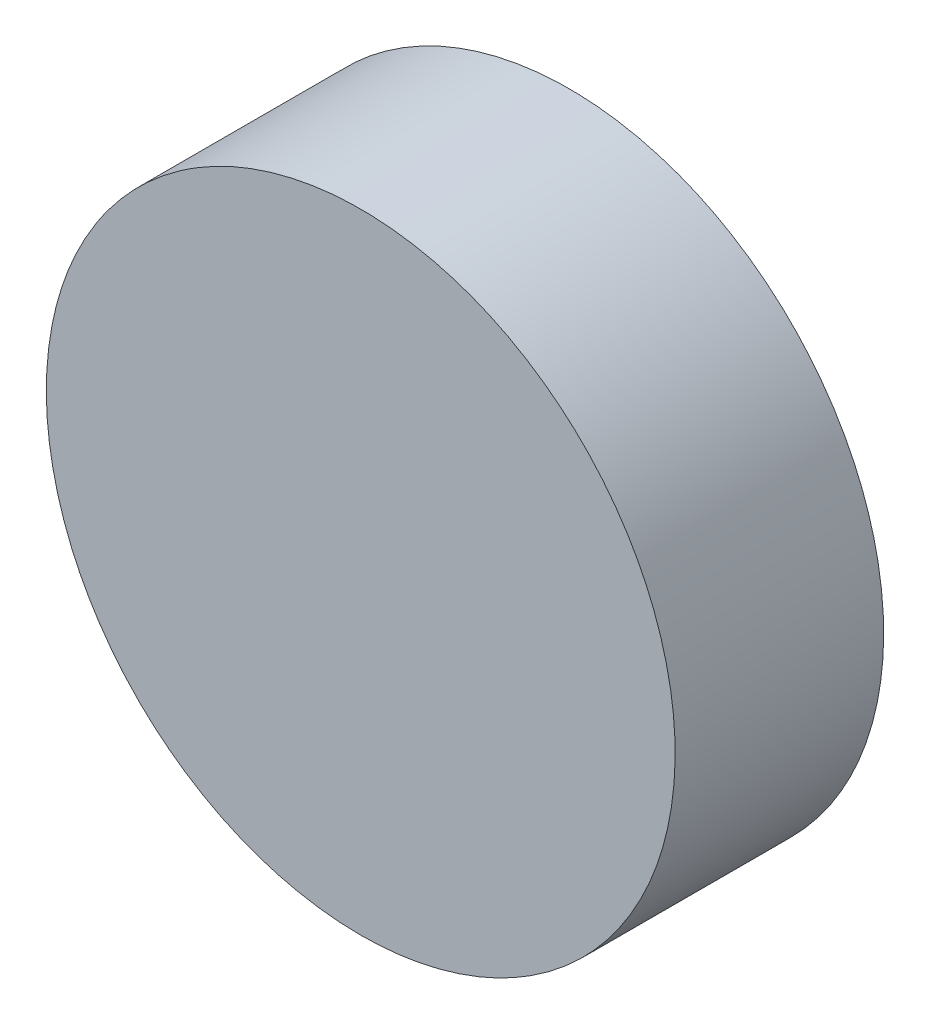
ISO-10303-21;
HEADER;
FILE_DESCRIPTION(('STEP AP214'),'2;1');
FILE_NAME('part.step','',(''),(''),'','','');
FILE_SCHEMA(('AUTOMOTIVE_DESIGN { 1 0 10303 214 1 1 1 1 }'));
ENDSEC;
DATA;
#1=APPLICATION_CONTEXT('core data for automotive mechanical design processes');
#2=APPLICATION_PROTOCOL_DEFINITION('international standard','automotive_design',2000,#1);
#3=PRODUCT_CONTEXT('',#1,'mechanical');
#4=PRODUCT('Part','Part','',(#3));
#5=PRODUCT_RELATED_PRODUCT_CATEGORY('part','',(#4));
#6=PRODUCT_DEFINITION_FORMATION('','',#4);
#7=PRODUCT_DEFINITION_CONTEXT('part definition',#1,'design');
#8=PRODUCT_DEFINITION('design','',#6,#7);
#9=PRODUCT_DEFINITION_SHAPE('','',#8);
#10=(LENGTH_UNIT() NAMED_UNIT(*) SI_UNIT(.MILLI.,.METRE.));
#11=(NAMED_UNIT(*) PLANE_ANGLE_UNIT() SI_UNIT($,.RADIAN.));
#12=(NAMED_UNIT(*) SI_UNIT($,.STERADIAN.) SOLID_ANGLE_UNIT());
#13=UNCERTAINTY_MEASURE_WITH_UNIT(LENGTH_MEASURE(1.E-05),#10,'distance_accuracy_value','');
#14=(GEOMETRIC_REPRESENTATION_CONTEXT(3) GLOBAL_UNCERTAINTY_ASSIGNED_CONTEXT((#13)) GLOBAL_UNIT_ASSIGNED_CONTEXT((#10,
#11,#12)) REPRESENTATION_CONTEXT('',''));
#15=CARTESIAN_POINT('',(0.,0.,0.));
#16=DIRECTION('',(0.,0.,1.));
#17=DIRECTION('',(1.,0.,0.));
#18=AXIS2_PLACEMENT_3D('',#15,#16,#17);
#19=CARTESIAN_POINT('',(3.01151364375242,66.8258452741405,123.808385168912));
#20=CARTESIAN_POINT('',(3.17974362296006,66.8258452741405,123.808385168912));
#21=CARTESIAN_POINT('',(3.51620358137534,66.8927713209974,123.808385168912));
#22=CARTESIAN_POINT('',(3.94405905102085,67.1786552059314,123.808385168912));
#23=CARTESIAN_POINT('',(4.22994293595491,67.606510675577,123.808385168912));
#24=CARTESIAN_POINT('',(4.33033200624017,68.1112006131998,123.808385168912));
#25=CARTESIAN_POINT('',(4.22994293595491,68.6158905508228,123.808385168912));
#26=CARTESIAN_POINT('',(3.94405905102085,69.0437460204683,123.808385168912));
#27=CARTESIAN_POINT('',(3.51620358137534,69.3296299054023,123.808385168912));
#28=CARTESIAN_POINT('',(3.01151364375242,69.4300189756876,123.808385168912));
#29=CARTESIAN_POINT('',(2.50682370612951,69.3296299054023,123.808385168912));
#30=CARTESIAN_POINT('',(2.078968236484,69.0437460204683,123.808385168912));
#31=CARTESIAN_POINT('',(1.79308435154994,68.6158905508227,123.808385168912));
#32=CARTESIAN_POINT('',(1.69269528126467,68.1112006131999,123.808385168912));
#33=CARTESIAN_POINT('',(1.79308435154994,67.606510675577,123.808385168912));
#34=CARTESIAN_POINT('',(2.078968236484,67.1786552059314,123.808385168912));
#35=CARTESIAN_POINT('',(2.50682370612951,66.8927713209974,123.808385168912));
#36=CARTESIAN_POINT('',(2.84328366454478,66.8258452741405,123.808385168912));
#37=CARTESIAN_POINT('',(3.01151364375242,66.8258452741405,123.808385168912));
#38=B_SPLINE_CURVE_WITH_KNOTS('',3,(#19,#20,#21,#22,#23,#24,#25,#26,#27,#28,#29,#30,#31,#32,#33,
#34,#35,#36,#37),.UNSPECIFIED.,.T.,.F.,(4,1,1,1,1,1,1,1,1,1,1,1,1,1,1,1,4),(0.,
0.0625000000000002,0.125,0.187499999999999,0.25,0.312500000000001,0.375,0.4375,0.5,0.5625,0.625,
0.687499999999999,0.75,0.812500000000001,0.875,0.9375,1.),.UNSPECIFIED.);
#39=DIRECTION('',(0.,0.,1.));
#40=VECTOR('',#39,1.);
#41=SURFACE_OF_LINEAR_EXTRUSION('',#38,#40);
#42=CARTESIAN_POINT('',(3.01151364375242,66.8258452741405,123.808385168912));
#43=CARTESIAN_POINT('',(3.17974362296006,66.8258452741405,123.808385168912));
#44=CARTESIAN_POINT('',(3.51620358137534,66.8927713209974,123.808385168912));
#45=CARTESIAN_POINT('',(3.94405905102085,67.1786552059314,123.808385168912));
#46=CARTESIAN_POINT('',(4.22994293595491,67.606510675577,123.808385168912));
#47=CARTESIAN_POINT('',(4.33033200624017,68.1112006131998,123.808385168912));
#48=CARTESIAN_POINT('',(4.22994293595491,68.6158905508228,123.808385168912));
#49=CARTESIAN_POINT('',(3.94405905102085,69.0437460204683,123.808385168912));
#50=CARTESIAN_POINT('',(3.51620358137534,69.3296299054023,123.808385168912));
#51=CARTESIAN_POINT('',(3.01151364375242,69.4300189756876,123.808385168912));
#52=CARTESIAN_POINT('',(2.50682370612951,69.3296299054023,123.808385168912));
#53=CARTESIAN_POINT('',(2.078968236484,69.0437460204683,123.808385168912));
#54=CARTESIAN_POINT('',(1.79308435154994,68.6158905508227,123.808385168912));
#55=CARTESIAN_POINT('',(1.69269528126467,68.1112006131999,123.808385168912));
#56=CARTESIAN_POINT('',(1.79308435154994,67.606510675577,123.808385168912));
#57=CARTESIAN_POINT('',(2.078968236484,67.1786552059314,123.808385168912));
#58=CARTESIAN_POINT('',(2.50682370612951,66.8927713209974,123.808385168912));
#59=CARTESIAN_POINT('',(2.84328366454478,66.8258452741405,123.808385168912));
#60=CARTESIAN_POINT('',(3.01151364375242,66.8258452741405,123.808385168912));
#61=B_SPLINE_CURVE_WITH_KNOTS('',3,(#42,#43,#44,#45,#46,#47,#48,#49,#50,#51,#52,#53,#54,#55,#56,
#57,#58,#59,#60),.UNSPECIFIED.,.T.,.F.,(4,1,1,1,1,1,1,1,1,1,1,1,1,1,1,1,4),(0.,
0.0625000000000002,0.125,0.187499999999999,0.25,0.312500000000001,0.375,0.4375,0.5,0.5625,0.625,
0.687499999999999,0.75,0.812500000000001,0.875,0.9375,1.),.UNSPECIFIED.);
#62=CARTESIAN_POINT('',(3.01151364375242,66.8258452741405,123.808385168912));
#63=VERTEX_POINT('',#62);
#64=EDGE_CURVE('E9',#63,#63,#61,.T.);
#65=ORIENTED_EDGE('',*,*,#64,.T.);
#66=EDGE_LOOP('',(#65));
#67=FACE_BOUND('',#66,.T.);
#68=CARTESIAN_POINT('',(3.01151364375242,66.8258452741405,124.660837467507));
#69=CARTESIAN_POINT('',(2.99048440016308,66.8258452589163,124.660837467507));
#70=CARTESIAN_POINT('',(2.96945559306154,66.8263681567347,124.660837467507));
#71=CARTESIAN_POINT('',(2.92744799680097,66.8284496611393,124.660837467507));
#72=CARTESIAN_POINT('',(2.90646921065742,66.8300083286574,124.660837467507));
#73=CARTESIAN_POINT('',(2.86461185127281,66.8341513949177,124.660837467507));
#74=CARTESIAN_POINT('',(2.84373328500815,66.8367358640485,124.660837467507));
#75=CARTESIAN_POINT('',(2.80212625785453,66.8429205914181,124.660837467507));
#76=CARTESIAN_POINT('',(2.78139780347898,66.8465208934665,124.660837467507));
#77=CARTESIAN_POINT('',(2.74014098256868,66.8547273847104,124.660837467507));
#78=CARTESIAN_POINT('',(2.71961261603394,66.8593335739059,124.660837467507));
#79=CARTESIAN_POINT('',(2.67880593450038,66.8695419551315,124.660837467507));
#80=CARTESIAN_POINT('',(2.65852760875462,66.8751441041938,124.660837467507));
#81=CARTESIAN_POINT('',(2.61827100073123,66.8873345121516,124.660837467507));
#82=CARTESIAN_POINT('',(2.59829269795855,66.8939227033487,124.660837467507));
#83=CARTESIAN_POINT('',(2.55868606070803,66.9080753143805,124.660837467507));
#84=CARTESIAN_POINT('',(2.53905770571091,66.9156396767615,124.660837467507));
#85=CARTESIAN_POINT('',(2.5002011958739,66.9317345701161,124.660837467507));
#86=CARTESIAN_POINT('',(2.48097304103401,66.9402651010898,124.660837467507));
#87=CARTESIAN_POINT('',(2.44295951199244,66.9582638156752,124.660837467507));
#88=CARTESIAN_POINT('',(2.42417416390736,66.9677320544222,124.660837467507));
#89=CARTESIAN_POINT('',(2.38708852337705,66.9875778546708,124.660837467507));
#90=CARTESIAN_POINT('',(2.36878826430963,66.9979554785345,124.660837467507));
#91=CARTESIAN_POINT('',(2.33271516702765,67.0195917446972,124.660837467507));
#92=CARTESIAN_POINT('',(2.31494235159661,67.0308504249783,124.660837467507));
#93=CARTESIAN_POINT('',(2.27996650987893,67.0542205352572,124.660837467507));
#94=CARTESIAN_POINT('',(2.26276348359229,67.0663319652551,124.660837467507));
#95=CARTESIAN_POINT('',(2.22896960344062,67.0913793209098,124.660837467507));
#96=CARTESIAN_POINT('',(2.21237872320365,67.1043152109822,124.660837467507));
#97=CARTESIAN_POINT('',(2.17985153433839,67.1309832162601,124.660837467507));
#98=CARTESIAN_POINT('',(2.16391518086813,67.1447152767636,124.660837467507));
#99=CARTESIAN_POINT('',(2.13273938908003,67.1729473883313,124.660837467507));
#100=CARTESIAN_POINT('',(2.11749990981826,67.1874473941676,124.660837467507));
#101=CARTESIAN_POINT('',(2.08776042472021,67.2171868792657,124.660837467507));
#102=CARTESIAN_POINT('',(2.07326041888392,67.2324263585275,124.660837467507));
#103=CARTESIAN_POINT('',(2.0450283073162,67.2636021503156,124.660837467507));
#104=CARTESIAN_POINT('',(2.03129624681271,67.2795385037858,124.660837467507));
#105=CARTESIAN_POINT('',(2.00462824153475,67.3120656926511,124.660837467507));
#106=CARTESIAN_POINT('',(1.99169235146232,67.328656572888,124.660837467507));
#107=CARTESIAN_POINT('',(1.96664499580767,67.3624504530397,124.660837467507));
#108=CARTESIAN_POINT('',(1.95453356580978,67.3796534793264,124.660837467507));
#109=CARTESIAN_POINT('',(1.93116345553083,67.414629321044,124.660837467507));
#110=CARTESIAN_POINT('',(1.91990477524976,67.4324021364749,124.660837467507));
#111=CARTESIAN_POINT('',(1.89826850908708,67.4684752337572,124.660837467507));
#112=CARTESIAN_POINT('',(1.88789088522342,67.486775492825,124.660837467507));
#113=CARTESIAN_POINT('',(1.86804508497478,67.5238611333543,124.660837467507));
#114=CARTESIAN_POINT('',(1.85857684622766,67.5426464814381,124.660837467507));
#115=CARTESIAN_POINT('',(1.84057813164245,67.5806600104832,124.660837467507));
#116=CARTESIAN_POINT('',(1.83204760066912,67.599888165328,124.660837467507));
#117=CARTESIAN_POINT('',(1.81595270731369,67.6387446751517,124.660837467507));
#118=CARTESIAN_POINT('',(1.8083883449316,67.6583730301305,124.660837467507));
#119=CARTESIAN_POINT('',(1.79423573390278,67.697979667431,124.660837467507));
#120=CARTESIAN_POINT('',(1.78764754270978,67.717957970272,124.660837467507));
#121=CARTESIAN_POINT('',(1.77545713474072,67.7582145781088,124.660837467507));
#122=CARTESIAN_POINT('',(1.76985498566302,67.7784929035997,124.660837467507));
#123=CARTESIAN_POINT('',(1.75964660447954,67.8192995858295,124.660837467507));
#124=CARTESIAN_POINT('',(1.7550404153415,67.8398279533155,124.660837467507));
#125=CARTESIAN_POINT('',(1.74683392394059,67.881084771627,124.660837467507));
#126=CARTESIAN_POINT('',(1.74323362167773,67.9018132224526,124.660837467507));
#127=CARTESIAN_POINT('',(1.73704889489406,67.9434202593047,124.660837467507));
#128=CARTESIAN_POINT('',(1.73446442656356,67.964298838817,124.660837467507));
#129=CARTESIAN_POINT('',(1.73032135811676,68.0061561620093,124.660837467507));
#130=CARTESIAN_POINT('',(1.72876268761223,68.0271348987172,124.660837467507));
#131=CARTESIAN_POINT('',(1.72668119136676,68.0691426300362,124.660837467507));
#132=CARTESIAN_POINT('',(1.7261583046931,68.090171621618,124.660837467507));
#133=CARTESIAN_POINT('',(1.7261583046931,68.1322296047817,124.660837467507));
#134=CARTESIAN_POINT('',(1.72668119136676,68.1532585963635,124.660837467507));
#135=CARTESIAN_POINT('',(1.72876268761223,68.1952663276825,124.660837467507));
#136=CARTESIAN_POINT('',(1.73032135811676,68.2162450643904,124.660837467507));
#137=CARTESIAN_POINT('',(1.73446442656356,68.2581023875827,124.660837467507));
#138=CARTESIAN_POINT('',(1.73704889489406,68.278980967095,124.660837467507));
#139=CARTESIAN_POINT('',(1.74323362167773,68.3205880039471,124.660837467507));
#140=CARTESIAN_POINT('',(1.74683392394059,68.3413164547727,124.660837467507));
#141=CARTESIAN_POINT('',(1.75504041534149,68.3825732730842,124.660837467507));
#142=CARTESIAN_POINT('',(1.75964660447954,68.4031016405702,124.660837467507));
#143=CARTESIAN_POINT('',(1.76985498566302,68.4439083228,124.660837467507));
#144=CARTESIAN_POINT('',(1.77545713474072,68.4641866482909,124.660837467507));
#145=CARTESIAN_POINT('',(1.78764754270978,68.5044432561278,124.660837467507));
#146=CARTESIAN_POINT('',(1.79423573390278,68.5244215589687,124.660837467507));
#147=CARTESIAN_POINT('',(1.8083883449316,68.5640281962692,124.660837467507));
#148=CARTESIAN_POINT('',(1.81595270731369,68.5836565512481,124.660837467507));
#149=CARTESIAN_POINT('',(1.83204760066911,68.6225130610717,124.660837467507));
#150=CARTESIAN_POINT('',(1.84057813164245,68.6417412159165,124.660837467507));
#151=CARTESIAN_POINT('',(1.85857684622766,68.6797547449616,124.660837467507));
#152=CARTESIAN_POINT('',(1.86804508497477,68.6985400930454,124.660837467507));
#153=CARTESIAN_POINT('',(1.88789088522341,68.7356257335747,124.660837467507));
#154=CARTESIAN_POINT('',(1.89826850908708,68.7539259926425,124.660837467507));
#155=CARTESIAN_POINT('',(1.91990477524977,68.7899990899247,124.660837467507));
#156=CARTESIAN_POINT('',(1.93116345553083,68.8077719053557,124.660837467507));
#157=CARTESIAN_POINT('',(1.95453356580978,68.8427477470733,124.660837467507));
#158=CARTESIAN_POINT('',(1.96664499580767,68.85995077336,124.660837467507));
#159=CARTESIAN_POINT('',(1.99169235146232,68.8937446535117,124.660837467507));
#160=CARTESIAN_POINT('',(2.00462824153476,68.9103355337486,124.660837467507));
#161=CARTESIAN_POINT('',(2.03129624681271,68.9428627226139,124.660837467507));
#162=CARTESIAN_POINT('',(2.0450283073162,68.9587990760841,124.660837467507));
#163=CARTESIAN_POINT('',(2.07326041888391,68.9899748678722,124.660837467507));
#164=CARTESIAN_POINT('',(2.08776042472021,69.005214347134,124.660837467507));
#165=CARTESIAN_POINT('',(2.11749990981827,69.0349538322321,124.660837467507));
#166=CARTESIAN_POINT('',(2.13273938908003,69.0494538380684,124.660837467507));
#167=CARTESIAN_POINT('',(2.16391518086813,69.0776859496361,124.660837467507));
#168=CARTESIAN_POINT('',(2.17985153433839,69.0914180101396,124.660837467507));
#169=CARTESIAN_POINT('',(2.21237872320365,69.1180860154175,124.660837467507));
#170=CARTESIAN_POINT('',(2.22896960344062,69.1310219054899,124.660837467507));
#171=CARTESIAN_POINT('',(2.2627634835923,69.1560692611446,124.660837467507));
#172=CARTESIAN_POINT('',(2.27996650987896,69.1681806911425,124.660837467507));
#173=CARTESIAN_POINT('',(2.31494235159657,69.1915508014214,124.660837467507));
#174=CARTESIAN_POINT('',(2.33271516702752,69.2028094817025,124.660837467507));
#175=CARTESIAN_POINT('',(2.36878826430976,69.2244457478652,124.660837467507));
#176=CARTESIAN_POINT('',(2.38708852337753,69.2348233717289,124.660837467507));
#177=CARTESIAN_POINT('',(2.42417416390688,69.2546691719775,124.660837467507));
#178=CARTESIAN_POINT('',(2.44295951199065,69.2641374107246,124.660837467507));
#179=CARTESIAN_POINT('',(2.48097304103581,69.2821361253098,124.660837467507));
#180=CARTESIAN_POINT('',(2.5002011958806,69.2906666562832,124.660837467507));
#181=CARTESIAN_POINT('',(2.53905770570422,69.3067615496386,124.660837467507));
#182=CARTESIAN_POINT('',(2.55868606068304,69.3143259120207,124.660837467507));
#183=CARTESIAN_POINT('',(2.59829269798354,69.3284785230495,124.660837467507));
#184=CARTESIAN_POINT('',(2.6182710008245,69.3350667142425,124.660837467507));
#185=CARTESIAN_POINT('',(2.65852760866134,69.3472571222116,124.660837467507));
#186=CARTESIAN_POINT('',(2.67880593415224,69.3528592712893,124.660837467507));
#187=CARTESIAN_POINT('',(2.7196126163821,69.3630676524727,124.660837467507));
#188=CARTESIAN_POINT('',(2.74014098386805,69.3676738416108,124.660837467507));
#189=CARTESIAN_POINT('',(2.78139780217961,69.3758803330117,124.660837467507));
#190=CARTESIAN_POINT('',(2.80212625300521,69.3794806352745,124.660837467507));
#191=CARTESIAN_POINT('',(2.84373328985726,69.3856653620582,124.660837467507));
#192=CARTESIAN_POINT('',(2.86461186936958,69.3882498303887,124.660837467507));
#193=CARTESIAN_POINT('',(2.90646919256189,69.3923928988355,124.660837467507));
#194=CARTESIAN_POINT('',(2.92744792926979,69.3939515693401,124.660837467507));
#195=CARTESIAN_POINT('',(2.96945566058876,69.3960330655855,124.660837467507));
#196=CARTESIAN_POINT('',(2.99048465217059,69.3965559522592,124.660837467507));
#197=CARTESIAN_POINT('',(3.03254263533426,69.3965559522592,124.660837467507));
#198=CARTESIAN_POINT('',(3.05357162691609,69.3960330655855,124.660837467507));
#199=CARTESIAN_POINT('',(3.09557935823506,69.3939515693401,124.660837467507));
#200=CARTESIAN_POINT('',(3.11655809494295,69.3923928988355,124.660837467507));
#201=CARTESIAN_POINT('',(3.15841541813527,69.3882498303887,124.660837467507));
#202=CARTESIAN_POINT('',(3.17929399764758,69.3856653620582,124.660837467507));
#203=CARTESIAN_POINT('',(3.22090103449963,69.3794806352745,124.660837467507));
#204=CARTESIAN_POINT('',(3.24162948532524,69.3758803330117,124.660837467507));
#205=CARTESIAN_POINT('',(3.2828863036368,69.3676738416108,124.660837467507));
#206=CARTESIAN_POINT('',(3.30341467112274,69.3630676524727,124.660837467507));
#207=CARTESIAN_POINT('',(3.34422135335261,69.3528592712893,124.660837467507));
#208=CARTESIAN_POINT('',(3.3644996788435,69.3472571222116,124.660837467507));
#209=CARTESIAN_POINT('',(3.40475628668034,69.3350667142425,124.660837467507));
#210=CARTESIAN_POINT('',(3.4247345895213,69.3284785230495,124.660837467507));
#211=CARTESIAN_POINT('',(3.46434122682181,69.3143259120207,124.660837467507));
#212=CARTESIAN_POINT('',(3.48396958180063,69.3067615496386,124.660837467507));
#213=CARTESIAN_POINT('',(3.52282609162425,69.2906666562832,124.660837467507));
#214=CARTESIAN_POINT('',(3.54205424646904,69.2821361253098,124.660837467507));
#215=CARTESIAN_POINT('',(3.5800677755142,69.2641374107246,124.660837467507));
#216=CARTESIAN_POINT('',(3.59885312359797,69.2546691719775,124.660837467507));
#217=CARTESIAN_POINT('',(3.63593876412731,69.2348233717289,124.660837467507));
#218=CARTESIAN_POINT('',(3.65423902319509,69.2244457478652,124.660837467507));
#219=CARTESIAN_POINT('',(3.69031212047733,69.2028094817025,124.660837467507));
#220=CARTESIAN_POINT('',(3.70808493590827,69.1915508014214,124.660837467507));
#221=CARTESIAN_POINT('',(3.74306077762588,69.1681806911425,124.660837467507));
#222=CARTESIAN_POINT('',(3.76026380391255,69.1560692611446,124.660837467507));
#223=CARTESIAN_POINT('',(3.79405768406423,69.1310219054899,124.660837467507));
#224=CARTESIAN_POINT('',(3.8106485643012,69.1180860154175,124.660837467507));
#225=CARTESIAN_POINT('',(3.84317575316646,69.0914180101396,124.660837467507));
#226=CARTESIAN_POINT('',(3.85911210663672,69.0776859496361,124.660837467507));
#227=CARTESIAN_POINT('',(3.89028789842481,69.0494538380683,124.660837467507));
#228=CARTESIAN_POINT('',(3.90552737768658,69.0349538322321,124.660837467507));
#229=CARTESIAN_POINT('',(3.93526686278464,69.005214347134,124.660837467507));
#230=CARTESIAN_POINT('',(3.94976686862093,68.9899748678722,124.660837467507));
#231=CARTESIAN_POINT('',(3.97799898018865,68.9587990760841,124.660837467507));
#232=CARTESIAN_POINT('',(3.99173104069214,68.9428627226139,124.660837467507));
#233=CARTESIAN_POINT('',(4.01839904597009,68.9103355337486,124.660837467507));
#234=CARTESIAN_POINT('',(4.03133493604253,68.8937446535117,124.660837467507));
#235=CARTESIAN_POINT('',(4.05638229169717,68.85995077336,124.660837467507));
#236=CARTESIAN_POINT('',(4.06849372169506,68.8427477470733,124.660837467507));
#237=CARTESIAN_POINT('',(4.09186383197402,68.8077719053557,124.660837467507));
#238=CARTESIAN_POINT('',(4.10312251225508,68.7899990899248,124.660837467507));
#239=CARTESIAN_POINT('',(4.12475877841777,68.7539259926425,124.660837467507));
#240=CARTESIAN_POINT('',(4.13513640228143,68.7356257335747,124.660837467507));
#241=CARTESIAN_POINT('',(4.15498220253007,68.6985400930454,124.660837467507));
#242=CARTESIAN_POINT('',(4.16445044127719,68.6797547449616,124.660837467507));
#243=CARTESIAN_POINT('',(4.1824491558624,68.6417412159165,124.660837467507));
#244=CARTESIAN_POINT('',(4.19097968683573,68.6225130610717,124.660837467507));
#245=CARTESIAN_POINT('',(4.20707458019116,68.5836565512481,124.660837467507));
#246=CARTESIAN_POINT('',(4.21463894257325,68.5640281962692,124.660837467507));
#247=CARTESIAN_POINT('',(4.22879155360207,68.5244215589687,124.660837467507));
#248=CARTESIAN_POINT('',(4.23537974479507,68.5044432561278,124.660837467507));
#249=CARTESIAN_POINT('',(4.24757015276413,68.4641866482909,124.660837467507));
#250=CARTESIAN_POINT('',(4.25317230184183,68.4439083228,124.660837467507));
#251=CARTESIAN_POINT('',(4.26338068302531,68.4031016405702,124.660837467507));
#252=CARTESIAN_POINT('',(4.26798687216335,68.3825732730842,124.660837467507));
#253=CARTESIAN_POINT('',(4.27619336356426,68.3413164547727,124.660837467507));
#254=CARTESIAN_POINT('',(4.27979366582711,68.3205880039471,124.660837467507));
#255=CARTESIAN_POINT('',(4.28597839261078,68.278980967095,124.660837467507));
#256=CARTESIAN_POINT('',(4.28856286094129,68.2581023875827,124.660837467507));
#257=CARTESIAN_POINT('',(4.29270592938809,68.2162450643904,124.660837467507));
#258=CARTESIAN_POINT('',(4.29426459989261,68.1952663276825,124.660837467507));
#259=CARTESIAN_POINT('',(4.29634609613809,68.1532585963635,124.660837467507));
#260=CARTESIAN_POINT('',(4.29686898281175,68.1322296047817,124.660837467507));
#261=CARTESIAN_POINT('',(4.29686898281175,68.090171621618,124.660837467507));
#262=CARTESIAN_POINT('',(4.29634609613809,68.0691426300362,124.660837467507));
#263=CARTESIAN_POINT('',(4.29426459989261,68.0271348987172,124.660837467507));
#264=CARTESIAN_POINT('',(4.29270592938809,68.0061561620093,124.660837467507));
#265=CARTESIAN_POINT('',(4.28856286094129,67.964298838817,124.660837467507));
#266=CARTESIAN_POINT('',(4.28597839261078,67.9434202593047,124.660837467507));
#267=CARTESIAN_POINT('',(4.27979366582711,67.9018132224526,124.660837467507));
#268=CARTESIAN_POINT('',(4.27619336356426,67.881084771627,124.660837467507));
#269=CARTESIAN_POINT('',(4.26798687216335,67.8398279533155,124.660837467507));
#270=CARTESIAN_POINT('',(4.26338068302531,67.8192995858295,124.660837467507));
#271=CARTESIAN_POINT('',(4.25317230184183,67.7784929035997,124.660837467507));
#272=CARTESIAN_POINT('',(4.24757015276413,67.7582145781088,124.660837467507));
#273=CARTESIAN_POINT('',(4.23537974479507,67.7179579702719,124.660837467507));
#274=CARTESIAN_POINT('',(4.22879155360207,67.697979667431,124.660837467507));
#275=CARTESIAN_POINT('',(4.21463894257325,67.6583730301305,124.660837467507));
#276=CARTESIAN_POINT('',(4.20707458019116,67.6387446751516,124.660837467507));
#277=CARTESIAN_POINT('',(4.19097968683573,67.599888165328,124.660837467507));
#278=CARTESIAN_POINT('',(4.1824491558624,67.5806600104832,124.660837467507));
#279=CARTESIAN_POINT('',(4.16445044127719,67.5426464814381,124.660837467507));
#280=CARTESIAN_POINT('',(4.15498220253007,67.5238611333543,124.660837467507));
#281=CARTESIAN_POINT('',(4.13513640228143,67.486775492825,124.660837467507));
#282=CARTESIAN_POINT('',(4.12475877841777,67.4684752337572,124.660837467507));
#283=CARTESIAN_POINT('',(4.10312251225508,67.432402136475,124.660837467507));
#284=CARTESIAN_POINT('',(4.09186383197402,67.414629321044,124.660837467507));
#285=CARTESIAN_POINT('',(4.06849372169507,67.3796534793264,124.660837467507));
#286=CARTESIAN_POINT('',(4.05638229169718,67.3624504530397,124.660837467507));
#287=CARTESIAN_POINT('',(4.03133493604253,67.328656572888,124.660837467507));
#288=CARTESIAN_POINT('',(4.01839904597009,67.3120656926511,124.660837467507));
#289=CARTESIAN_POINT('',(3.99173104069214,67.2795385037858,124.660837467507));
#290=CARTESIAN_POINT('',(3.97799898018865,67.2636021503156,124.660837467507));
#291=CARTESIAN_POINT('',(3.94976686862093,67.2324263585274,124.660837467507));
#292=CARTESIAN_POINT('',(3.93526686278464,67.2171868792657,124.660837467507));
#293=CARTESIAN_POINT('',(3.90552737768658,67.1874473941676,124.660837467507));
#294=CARTESIAN_POINT('',(3.89028789842481,67.1729473883313,124.660837467507));
#295=CARTESIAN_POINT('',(3.85911210663671,67.1447152767636,124.660837467507));
#296=CARTESIAN_POINT('',(3.84317575316645,67.1309832162601,124.660837467507));
#297=CARTESIAN_POINT('',(3.81064856430119,67.1043152109822,124.660837467507));
#298=CARTESIAN_POINT('',(3.79405768406422,67.0913793209098,124.660837467507));
#299=CARTESIAN_POINT('',(3.76026380391256,67.0663319652551,124.660837467507));
#300=CARTESIAN_POINT('',(3.74306077762592,67.0542205352572,124.660837467507));
#301=CARTESIAN_POINT('',(3.70808493590824,67.0308504249783,124.660837467507));
#302=CARTESIAN_POINT('',(3.6903121204772,67.0195917446972,124.660837467507));
#303=CARTESIAN_POINT('',(3.65423902319522,66.9979554785345,124.660837467507));
#304=CARTESIAN_POINT('',(3.63593876412779,66.9875778546708,124.660837467507));
#305=CARTESIAN_POINT('',(3.59885312359748,66.9677320544222,124.660837467507));
#306=CARTESIAN_POINT('',(3.5800677755124,66.9582638156752,124.660837467507));
#307=CARTESIAN_POINT('',(3.54205424647083,66.9402651010898,124.660837467507));
#308=CARTESIAN_POINT('',(3.52282609163094,66.9317345701161,124.660837467507));
#309=CARTESIAN_POINT('',(3.48396958179393,66.9156396767615,124.660837467507));
#310=CARTESIAN_POINT('',(3.46434122679682,66.9080753143805,124.660837467507));
#311=CARTESIAN_POINT('',(3.4247345895463,66.8939227033487,124.660837467507));
#312=CARTESIAN_POINT('',(3.40475628677362,66.8873345121516,124.660837467507));
#313=CARTESIAN_POINT('',(3.36449967875022,66.8751441041938,124.660837467507));
#314=CARTESIAN_POINT('',(3.34422135300447,66.8695419551315,124.660837467507));
#315=CARTESIAN_POINT('',(3.3034146714709,66.8593335739059,124.660837467507));
#316=CARTESIAN_POINT('',(3.28288630493617,66.8547273847104,124.660837467507));
#317=CARTESIAN_POINT('',(3.24162948402587,66.8465208934665,124.660837467507));
#318=CARTESIAN_POINT('',(3.22090102965031,66.8429205914181,124.660837467507));
#319=CARTESIAN_POINT('',(3.1792940024967,66.8367358640485,124.660837467507));
#320=CARTESIAN_POINT('',(3.15841543623204,66.8341513949177,124.660837467507));
#321=CARTESIAN_POINT('',(3.11655807684742,66.8300083286574,124.660837467507));
#322=CARTESIAN_POINT('',(3.09557929070387,66.8284496611393,124.660837467507));
#323=CARTESIAN_POINT('',(3.0535716944433,66.8263681567347,124.660837467507));
#324=CARTESIAN_POINT('',(3.03254288734177,66.8258452589163,124.660837467507));
#325=CARTESIAN_POINT('',(3.01151364375242,66.8258452741405,124.660837467507));
#326=B_SPLINE_CURVE_WITH_KNOTS('',3,(#68,#69,#70,#71,#72,#73,#74,#75,#76,#77,#78,#79,#80,#81,
#82,#83,#84,#85,#86,#87,#88,#89,#90,#91,#92,#93,#94,#95,#96,#97,#98,#99,#100,#101,#102,#103,
#104,#105,#106,#107,#108,#109,#110,#111,#112,#113,#114,#115,#116,#117,#118,#119,#120,#121,#122,
#123,#124,#125,#126,#127,#128,#129,#130,#131,#132,#133,#134,#135,#136,#137,#138,#139,#140,#141,
#142,#143,#144,#145,#146,#147,#148,#149,#150,#151,#152,#153,#154,#155,#156,#157,#158,#159,#160,
#161,#162,#163,#164,#165,#166,#167,#168,#169,#170,#171,#172,#173,#174,#175,#176,#177,#178,#179,
#180,#181,#182,#183,#184,#185,#186,#187,#188,#189,#190,#191,#192,#193,#194,#195,#196,#197,#198,
#199,#200,#201,#202,#203,#204,#205,#206,#207,#208,#209,#210,#211,#212,#213,#214,#215,#216,#217,
#218,#219,#220,#221,#222,#223,#224,#225,#226,#227,#228,#229,#230,#231,#232,#233,#234,#235,#236,
#237,#238,#239,#240,#241,#242,#243,#244,#245,#246,#247,#248,#249,#250,#251,#252,#253,#254,#255,
#256,#257,#258,#259,#260,#261,#262,#263,#264,#265,#266,#267,#268,#269,#270,#271,#272,#273,#274,
#275,#276,#277,#278,#279,#280,#281,#282,#283,#284,#285,#286,#287,#288,#289,#290,#291,#292,#293,
#294,#295,#296,#297,#298,#299,#300,#301,#302,#303,#304,#305,#306,#307,#308,#309,#310,#311,#312,
#313,#314,#315,#316,#317,#318,#319,#320,#321,#322,#323,#324,#325),.UNSPECIFIED.,.F.,.F.,(4,2,2,
2,2,2,2,2,2,2,2,2,2,2,2,2,2,2,2,2,2,2,2,2,2,2,2,2,2,2,2,2,2,2,2,2,2,2,2,2,2,2,2,2,2,2,2,2,2,2,2,
2,2,2,2,2,2,2,2,2,2,2,2,2,2,2,2,2,2,2,2,2,2,2,2,2,2,2,2,2,2,2,2,2,2,2,2,2,2,2,2,2,2,2,2,2,2,2,2,
2,2,2,2,2,2,2,2,2,2,2,2,2,2,2,2,2,2,2,2,2,2,2,2,2,2,2,2,2,4),(0.,0.0630806127990775,
0.126164936809588,0.189253590290846,0.252344965001653,0.315436339712458,0.37852499319372,
0.441609317204232,0.504689930003308,0.567770542802382,0.6308548668129,0.693943520294159,
0.757034895004963,0.820126269715775,0.883214923197029,0.946299247207536,1.00937986000661,
1.07246047280571,1.13554479681622,1.19863345029747,1.26172482500827,1.32481619971909,
1.38790485320037,1.45098917721087,1.51406979000994,1.57715040280904,1.64023472681954,
1.7033233803008,1.7664147550116,1.82950612972239,1.89259478320366,1.95567910721416,
2.01875972001324,2.08184033281232,2.14492465682282,2.20801331030409,2.27110468501489,
2.3341960597257,2.39728471320696,2.46036903721746,2.52344965001655,2.58653026281562,
2.64961458682614,2.71270324030738,2.77579461501819,2.838885989729,2.90197464321026,
2.96505896722079,3.02813958001985,3.09122019281895,3.15430451682945,3.21739317031071,
3.28048454502152,3.34357591973232,3.40666457321358,3.46974889722409,3.53282951002317,
3.59591012282225,3.65899444683276,3.72208310031402,3.78517447502483,3.84826584973563,
3.91135450321689,3.9744388272274,4.03751944002648,4.10060005282556,4.16368437683607,
4.22677303031733,4.28986440502814,4.35295577973894,4.4160444332202,4.47912875723071,
4.54220937002979,4.60528998282887,4.66837430683938,4.73146296032064,4.79455433503145,
4.85764570974226,4.92073436322351,4.98381868723403,5.04689930003311,5.10997991283218,
5.17306423684269,5.23615289032395,5.29924426503475,5.36233563974556,5.42542429322683,
5.48850861723734,5.55158923003641,5.61466984283551,5.67775416684602,5.74084282032727,
5.80393419503808,5.86702556974888,5.93011422323015,5.99319854724065,6.05627916003973,
6.1193597728388,6.18244409684932,6.24553275033057,6.30862412504137,6.37171549975218,
6.43480415323344,6.49788847724394,6.56096909004304,6.6240497028421,6.6871340268526,
6.75022268033386,6.8133140550447,6.8764054297555,6.93949408323675,7.00257840724727,
7.06565902004635,7.12873963284542,7.19182395685593,7.25491261033719,7.318003985048,
7.38109535975881,7.44418401324007,7.50726833725059,7.57034895004966,7.63342956284873,
7.69651388685925,7.7596025403405,7.82269391505131,7.88578528976212,7.94887394324338,
8.01195826725389,8.07503888005296),.UNSPECIFIED.);
#327=CARTESIAN_POINT('',(3.01151364375242,66.8258452741405,124.660837467507));
#328=VERTEX_POINT('',#327);
#329=EDGE_CURVE('E24',#328,#328,#326,.F.);
#330=ORIENTED_EDGE('',*,*,#329,.F.);
#331=EDGE_LOOP('',(#330));
#332=FACE_BOUND('',#331,.T.);
#333=ADVANCED_FACE('F14',(#67,#332),#41,.T.);
#334=CARTESIAN_POINT('',(16.7615136437524,68.1112006131999,123.808385168912));
#335=DIRECTION('',(0.,0.,1.));
#336=DIRECTION('',(0.,-1.,0.));
#337=AXIS2_PLACEMENT_3D('',#334,#335,#336);
#338=PLANE('',#337);
#339=ORIENTED_EDGE('',*,*,#64,.F.);
#340=EDGE_LOOP('',(#339));
#341=FACE_BOUND('',#340,.T.);
#342=ADVANCED_FACE('F62',(#341),#338,.F.);
#343=CARTESIAN_POINT('',(16.7615136437524,68.1112006131999,124.660837467507));
#344=DIRECTION('',(0.,0.,1.));
#345=DIRECTION('',(0.,-1.,0.));
#346=AXIS2_PLACEMENT_3D('',#343,#344,#345);
#347=PLANE('',#346);
#348=ORIENTED_EDGE('',*,*,#329,.T.);
#349=EDGE_LOOP('',(#348));
#350=FACE_BOUND('',#349,.T.);
#351=ADVANCED_FACE('F31',(#350),#347,.T.);
#352=CLOSED_SHELL('',(#333,#342,#351));
#353=MANIFOLD_SOLID_BREP('B1',#352);
#354=ADVANCED_BREP_SHAPE_REPRESENTATION('',(#18,#353),#14);
#355=SHAPE_DEFINITION_REPRESENTATION(#9,#354);
ENDSEC;
END-ISO-10303-21;
